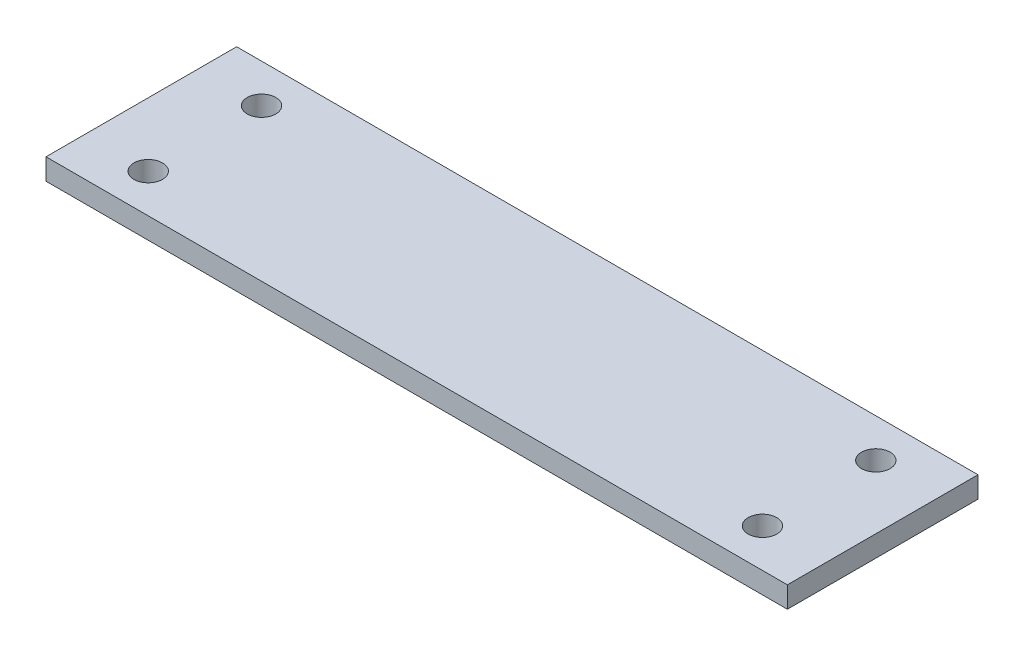
ISO-10303-21;
HEADER;
FILE_DESCRIPTION(('STEP AP214'),'2;1');
FILE_NAME('part.step','',(''),(''),'','','');
FILE_SCHEMA(('AUTOMOTIVE_DESIGN { 1 0 10303 214 1 1 1 1 }'));
ENDSEC;
DATA;
#1=APPLICATION_CONTEXT('core data for automotive mechanical design processes');
#2=APPLICATION_PROTOCOL_DEFINITION('international standard','automotive_design',2000,#1);
#3=PRODUCT_CONTEXT('',#1,'mechanical');
#4=PRODUCT('Part','Part','',(#3));
#5=PRODUCT_RELATED_PRODUCT_CATEGORY('part','',(#4));
#6=PRODUCT_DEFINITION_FORMATION('','',#4);
#7=PRODUCT_DEFINITION_CONTEXT('part definition',#1,'design');
#8=PRODUCT_DEFINITION('design','',#6,#7);
#9=PRODUCT_DEFINITION_SHAPE('','',#8);
#10=(LENGTH_UNIT() NAMED_UNIT(*) SI_UNIT(.MILLI.,.METRE.));
#11=(NAMED_UNIT(*) PLANE_ANGLE_UNIT() SI_UNIT($,.RADIAN.));
#12=(NAMED_UNIT(*) SI_UNIT($,.STERADIAN.) SOLID_ANGLE_UNIT());
#13=UNCERTAINTY_MEASURE_WITH_UNIT(LENGTH_MEASURE(1.E-05),#10,'distance_accuracy_value','');
#14=(GEOMETRIC_REPRESENTATION_CONTEXT(3) GLOBAL_UNCERTAINTY_ASSIGNED_CONTEXT((#13)) GLOBAL_UNIT_ASSIGNED_CONTEXT((#10,
#11,#12)) REPRESENTATION_CONTEXT('',''));
#15=CARTESIAN_POINT('',(0.,0.,0.));
#16=DIRECTION('',(0.,0.,1.));
#17=DIRECTION('',(1.,0.,0.));
#18=AXIS2_PLACEMENT_3D('',#15,#16,#17);
#19=CARTESIAN_POINT('',(35.,2.,0.));
#20=DIRECTION('',(1.,0.,0.));
#21=DIRECTION('',(0.,0.,-1.));
#22=AXIS2_PLACEMENT_3D('',#19,#20,#21);
#23=PLANE('',#22);
#24=DIRECTION('',(0.,0.,1.));
#25=VECTOR('',#24,1.);
#26=CARTESIAN_POINT('',(35.,0.,0.));
#27=LINE('',#26,#25);
#28=CARTESIAN_POINT('',(35.,0.,-9.));
#29=VERTEX_POINT('',#28);
#30=CARTESIAN_POINT('',(35.,0.,9.));
#31=VERTEX_POINT('',#30);
#32=EDGE_CURVE('E115',#29,#31,#27,.T.);
#33=ORIENTED_EDGE('',*,*,#32,.F.);
#34=DIRECTION('',(0.,-1.,0.));
#35=VECTOR('',#34,1.);
#36=CARTESIAN_POINT('',(35.,2.,-9.));
#37=LINE('',#36,#35);
#38=CARTESIAN_POINT('',(35.,2.,-9.));
#39=VERTEX_POINT('',#38);
#40=EDGE_CURVE('E11',#39,#29,#37,.T.);
#41=ORIENTED_EDGE('',*,*,#40,.F.);
#42=DIRECTION('',(0.,0.,1.));
#43=VECTOR('',#42,1.);
#44=CARTESIAN_POINT('',(35.,2.,0.));
#45=LINE('',#44,#43);
#46=CARTESIAN_POINT('',(35.,2.,9.));
#47=VERTEX_POINT('',#46);
#48=EDGE_CURVE('E96',#39,#47,#45,.T.);
#49=ORIENTED_EDGE('',*,*,#48,.T.);
#50=DIRECTION('',(0.,-1.,0.));
#51=VECTOR('',#50,1.);
#52=CARTESIAN_POINT('',(35.,2.,9.));
#53=LINE('',#52,#51);
#54=EDGE_CURVE('E75',#47,#31,#53,.T.);
#55=ORIENTED_EDGE('',*,*,#54,.T.);
#56=EDGE_LOOP('',(#33,#41,#49,#55));
#57=FACE_BOUND('',#56,.T.);
#58=ADVANCED_FACE('F35',(#57),#23,.T.);
#59=CARTESIAN_POINT('',(0.,2.,-9.));
#60=DIRECTION('',(0.,0.,-1.));
#61=DIRECTION('',(-1.,0.,0.));
#62=AXIS2_PLACEMENT_3D('',#59,#60,#61);
#63=PLANE('',#62);
#64=DIRECTION('',(1.,0.,0.));
#65=VECTOR('',#64,1.);
#66=CARTESIAN_POINT('',(0.,0.,-9.));
#67=LINE('',#66,#65);
#68=CARTESIAN_POINT('',(-35.,0.,-9.));
#69=VERTEX_POINT('',#68);
#70=EDGE_CURVE('E87',#69,#29,#67,.T.);
#71=ORIENTED_EDGE('',*,*,#70,.F.);
#72=DIRECTION('',(0.,-1.,0.));
#73=VECTOR('',#72,1.);
#74=CARTESIAN_POINT('',(-35.,2.,-9.));
#75=LINE('',#74,#73);
#76=CARTESIAN_POINT('',(-35.,2.,-9.));
#77=VERTEX_POINT('',#76);
#78=EDGE_CURVE('E44',#77,#69,#75,.T.);
#79=ORIENTED_EDGE('',*,*,#78,.F.);
#80=DIRECTION('',(1.,0.,0.));
#81=VECTOR('',#80,1.);
#82=CARTESIAN_POINT('',(0.,2.,-9.));
#83=LINE('',#82,#81);
#84=EDGE_CURVE('E85',#77,#39,#83,.T.);
#85=ORIENTED_EDGE('',*,*,#84,.T.);
#86=ORIENTED_EDGE('',*,*,#40,.T.);
#87=EDGE_LOOP('',(#71,#79,#85,#86));
#88=FACE_BOUND('',#87,.T.);
#89=ADVANCED_FACE('F83',(#88),#63,.T.);
#90=CARTESIAN_POINT('',(-35.,2.,0.));
#91=DIRECTION('',(1.,0.,0.));
#92=DIRECTION('',(0.,0.,-1.));
#93=AXIS2_PLACEMENT_3D('',#90,#91,#92);
#94=PLANE('',#93);
#95=DIRECTION('',(0.,0.,1.));
#96=VECTOR('',#95,1.);
#97=CARTESIAN_POINT('',(-35.,0.,0.));
#98=LINE('',#97,#96);
#99=CARTESIAN_POINT('',(-35.,0.,9.));
#100=VERTEX_POINT('',#99);
#101=EDGE_CURVE('E118',#69,#100,#98,.T.);
#102=ORIENTED_EDGE('',*,*,#101,.T.);
#103=DIRECTION('',(0.,-1.,0.));
#104=VECTOR('',#103,1.);
#105=CARTESIAN_POINT('',(-35.,2.,9.));
#106=LINE('',#105,#104);
#107=CARTESIAN_POINT('',(-35.,2.,9.));
#108=VERTEX_POINT('',#107);
#109=EDGE_CURVE('E90',#108,#100,#106,.T.);
#110=ORIENTED_EDGE('',*,*,#109,.F.);
#111=DIRECTION('',(0.,0.,1.));
#112=VECTOR('',#111,1.);
#113=CARTESIAN_POINT('',(-35.,2.,0.));
#114=LINE('',#113,#112);
#115=EDGE_CURVE('E92',#77,#108,#114,.T.);
#116=ORIENTED_EDGE('',*,*,#115,.F.);
#117=ORIENTED_EDGE('',*,*,#78,.T.);
#118=EDGE_LOOP('',(#102,#110,#116,#117));
#119=FACE_BOUND('',#118,.T.);
#120=ADVANCED_FACE('F93',(#119),#94,.F.);
#121=CARTESIAN_POINT('',(-29.,2.,-5.35));
#122=DIRECTION('',(0.,-1.,0.));
#123=DIRECTION('',(0.,0.,-1.));
#124=AXIS2_PLACEMENT_3D('',#121,#122,#123);
#125=CYLINDRICAL_SURFACE('',#124,1.35);
#126=CARTESIAN_POINT('',(-29.,2.,-5.35));
#127=DIRECTION('',(0.,1.,0.));
#128=DIRECTION('',(0.,0.,1.));
#129=AXIS2_PLACEMENT_3D('',#126,#127,#128);
#130=CIRCLE('',#129,1.35);
#131=CARTESIAN_POINT('',(-29.,2.,-4.));
#132=VERTEX_POINT('',#131);
#133=EDGE_CURVE('E98',#132,#132,#130,.T.);
#134=ORIENTED_EDGE('',*,*,#133,.T.);
#135=EDGE_LOOP('',(#134));
#136=FACE_BOUND('',#135,.T.);
#137=CARTESIAN_POINT('',(-29.,0.,-5.35));
#138=DIRECTION('',(0.,1.,0.));
#139=DIRECTION('',(0.,0.,1.));
#140=AXIS2_PLACEMENT_3D('',#137,#138,#139);
#141=CIRCLE('',#140,1.35);
#142=CARTESIAN_POINT('',(-29.,0.,-4.));
#143=VERTEX_POINT('',#142);
#144=EDGE_CURVE('E112',#143,#143,#141,.T.);
#145=ORIENTED_EDGE('',*,*,#144,.F.);
#146=EDGE_LOOP('',(#145));
#147=FACE_BOUND('',#146,.T.);
#148=ADVANCED_FACE('F134',(#136,#147),#125,.F.);
#149=CARTESIAN_POINT('',(29.,2.,5.35));
#150=DIRECTION('',(0.,-1.,0.));
#151=DIRECTION('',(0.,0.,-1.));
#152=AXIS2_PLACEMENT_3D('',#149,#150,#151);
#153=CYLINDRICAL_SURFACE('',#152,1.35);
#154=CARTESIAN_POINT('',(29.,2.,5.35));
#155=DIRECTION('',(0.,1.,0.));
#156=DIRECTION('',(0.,0.,1.));
#157=AXIS2_PLACEMENT_3D('',#154,#155,#156);
#158=CIRCLE('',#157,1.35);
#159=CARTESIAN_POINT('',(29.,2.,6.7));
#160=VERTEX_POINT('',#159);
#161=EDGE_CURVE('E240',#160,#160,#158,.T.);
#162=ORIENTED_EDGE('',*,*,#161,.T.);
#163=EDGE_LOOP('',(#162));
#164=FACE_BOUND('',#163,.T.);
#165=CARTESIAN_POINT('',(29.,0.,5.35));
#166=DIRECTION('',(0.,1.,0.));
#167=DIRECTION('',(0.,0.,1.));
#168=AXIS2_PLACEMENT_3D('',#165,#166,#167);
#169=CIRCLE('',#168,1.35);
#170=CARTESIAN_POINT('',(29.,0.,6.7));
#171=VERTEX_POINT('',#170);
#172=EDGE_CURVE('E109',#171,#171,#169,.T.);
#173=ORIENTED_EDGE('',*,*,#172,.F.);
#174=EDGE_LOOP('',(#173));
#175=FACE_BOUND('',#174,.T.);
#176=ADVANCED_FACE('F137',(#164,#175),#153,.F.);
#177=CARTESIAN_POINT('',(29.,2.,-5.35));
#178=DIRECTION('',(0.,-1.,0.));
#179=DIRECTION('',(0.,0.,-1.));
#180=AXIS2_PLACEMENT_3D('',#177,#178,#179);
#181=CYLINDRICAL_SURFACE('',#180,1.35);
#182=CARTESIAN_POINT('',(29.,2.,-5.35));
#183=DIRECTION('',(0.,1.,0.));
#184=DIRECTION('',(0.,0.,1.));
#185=AXIS2_PLACEMENT_3D('',#182,#183,#184);
#186=CIRCLE('',#185,1.35);
#187=CARTESIAN_POINT('',(29.,2.,-4.));
#188=VERTEX_POINT('',#187);
#189=EDGE_CURVE('E151',#188,#188,#186,.T.);
#190=ORIENTED_EDGE('',*,*,#189,.T.);
#191=EDGE_LOOP('',(#190));
#192=FACE_BOUND('',#191,.T.);
#193=CARTESIAN_POINT('',(29.,0.,-5.35));
#194=DIRECTION('',(0.,1.,0.));
#195=DIRECTION('',(0.,0.,1.));
#196=AXIS2_PLACEMENT_3D('',#193,#194,#195);
#197=CIRCLE('',#196,1.35);
#198=CARTESIAN_POINT('',(29.,0.,-4.));
#199=VERTEX_POINT('',#198);
#200=EDGE_CURVE('E106',#199,#199,#197,.T.);
#201=ORIENTED_EDGE('',*,*,#200,.F.);
#202=EDGE_LOOP('',(#201));
#203=FACE_BOUND('',#202,.T.);
#204=ADVANCED_FACE('F140',(#192,#203),#181,.F.);
#205=CARTESIAN_POINT('',(-29.,2.,5.35));
#206=DIRECTION('',(0.,-1.,0.));
#207=DIRECTION('',(0.,0.,-1.));
#208=AXIS2_PLACEMENT_3D('',#205,#206,#207);
#209=CYLINDRICAL_SURFACE('',#208,1.35);
#210=CARTESIAN_POINT('',(-29.,2.,5.35));
#211=DIRECTION('',(0.,1.,0.));
#212=DIRECTION('',(0.,0.,1.));
#213=AXIS2_PLACEMENT_3D('',#210,#211,#212);
#214=CIRCLE('',#213,1.35);
#215=CARTESIAN_POINT('',(-29.,2.,6.7));
#216=VERTEX_POINT('',#215);
#217=EDGE_CURVE('E121',#216,#216,#214,.T.);
#218=ORIENTED_EDGE('',*,*,#217,.T.);
#219=EDGE_LOOP('',(#218));
#220=FACE_BOUND('',#219,.T.);
#221=CARTESIAN_POINT('',(-29.,0.,5.35));
#222=DIRECTION('',(0.,1.,0.));
#223=DIRECTION('',(0.,0.,1.));
#224=AXIS2_PLACEMENT_3D('',#221,#222,#223);
#225=CIRCLE('',#224,1.35);
#226=CARTESIAN_POINT('',(-29.,0.,6.7));
#227=VERTEX_POINT('',#226);
#228=EDGE_CURVE('E103',#227,#227,#225,.T.);
#229=ORIENTED_EDGE('',*,*,#228,.F.);
#230=EDGE_LOOP('',(#229));
#231=FACE_BOUND('',#230,.T.);
#232=ADVANCED_FACE('F37',(#220,#231),#209,.F.);
#233=CARTESIAN_POINT('',(0.,2.,9.));
#234=DIRECTION('',(0.,0.,-1.));
#235=DIRECTION('',(-1.,0.,0.));
#236=AXIS2_PLACEMENT_3D('',#233,#234,#235);
#237=PLANE('',#236);
#238=DIRECTION('',(1.,0.,0.));
#239=VECTOR('',#238,1.);
#240=CARTESIAN_POINT('',(0.,0.,9.));
#241=LINE('',#240,#239);
#242=EDGE_CURVE('E68',#100,#31,#241,.T.);
#243=ORIENTED_EDGE('',*,*,#242,.T.);
#244=ORIENTED_EDGE('',*,*,#54,.F.);
#245=DIRECTION('',(1.,0.,0.));
#246=VECTOR('',#245,1.);
#247=CARTESIAN_POINT('',(0.,2.,9.));
#248=LINE('',#247,#246);
#249=EDGE_CURVE('E52',#108,#47,#248,.T.);
#250=ORIENTED_EDGE('',*,*,#249,.F.);
#251=ORIENTED_EDGE('',*,*,#109,.T.);
#252=EDGE_LOOP('',(#243,#244,#250,#251));
#253=FACE_BOUND('',#252,.T.);
#254=ADVANCED_FACE('F124',(#253),#237,.F.);
#255=CARTESIAN_POINT('',(0.,2.,0.));
#256=DIRECTION('',(0.,1.,0.));
#257=DIRECTION('',(0.,0.,1.));
#258=AXIS2_PLACEMENT_3D('',#255,#256,#257);
#259=PLANE('',#258);
#260=ORIENTED_EDGE('',*,*,#217,.F.);
#261=EDGE_LOOP('',(#260));
#262=FACE_BOUND('',#261,.T.);
#263=ORIENTED_EDGE('',*,*,#189,.F.);
#264=EDGE_LOOP('',(#263));
#265=FACE_BOUND('',#264,.T.);
#266=ORIENTED_EDGE('',*,*,#161,.F.);
#267=EDGE_LOOP('',(#266));
#268=FACE_BOUND('',#267,.T.);
#269=ORIENTED_EDGE('',*,*,#133,.F.);
#270=EDGE_LOOP('',(#269));
#271=FACE_BOUND('',#270,.T.);
#272=ORIENTED_EDGE('',*,*,#48,.F.);
#273=ORIENTED_EDGE('',*,*,#84,.F.);
#274=ORIENTED_EDGE('',*,*,#115,.T.);
#275=ORIENTED_EDGE('',*,*,#249,.T.);
#276=EDGE_LOOP('',(#272,#273,#274,#275));
#277=FACE_BOUND('',#276,.T.);
#278=ADVANCED_FACE('F95',(#262,#265,#268,#271,#277),#259,.T.);
#279=CARTESIAN_POINT('',(0.,0.,0.));
#280=DIRECTION('',(0.,1.,0.));
#281=DIRECTION('',(0.,0.,1.));
#282=AXIS2_PLACEMENT_3D('',#279,#280,#281);
#283=PLANE('',#282);
#284=ORIENTED_EDGE('',*,*,#228,.T.);
#285=EDGE_LOOP('',(#284));
#286=FACE_BOUND('',#285,.T.);
#287=ORIENTED_EDGE('',*,*,#200,.T.);
#288=EDGE_LOOP('',(#287));
#289=FACE_BOUND('',#288,.T.);
#290=ORIENTED_EDGE('',*,*,#172,.T.);
#291=EDGE_LOOP('',(#290));
#292=FACE_BOUND('',#291,.T.);
#293=ORIENTED_EDGE('',*,*,#144,.T.);
#294=EDGE_LOOP('',(#293));
#295=FACE_BOUND('',#294,.T.);
#296=ORIENTED_EDGE('',*,*,#32,.T.);
#297=ORIENTED_EDGE('',*,*,#242,.F.);
#298=ORIENTED_EDGE('',*,*,#101,.F.);
#299=ORIENTED_EDGE('',*,*,#70,.T.);
#300=EDGE_LOOP('',(#296,#297,#298,#299));
#301=FACE_BOUND('',#300,.T.);
#302=ADVANCED_FACE('F125',(#286,#289,#292,#295,#301),#283,.F.);
#303=CLOSED_SHELL('',(#58,#89,#120,#148,#176,#204,#232,#254,#278,#302));
#304=MANIFOLD_SOLID_BREP('B2',#303);
#305=ADVANCED_BREP_SHAPE_REPRESENTATION('',(#18,#304),#14);
#306=SHAPE_DEFINITION_REPRESENTATION(#9,#305);
ENDSEC;
END-ISO-10303-21;
